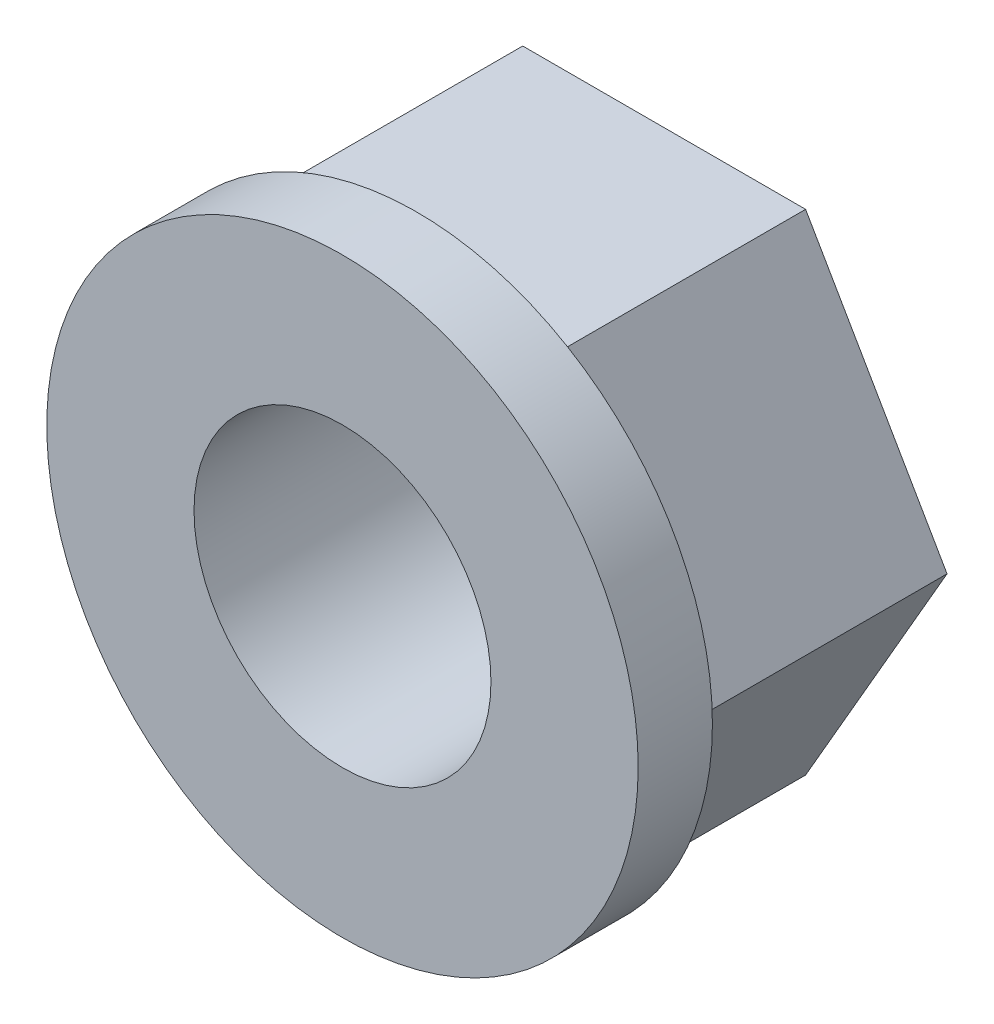
ISO-10303-21;
HEADER;
FILE_DESCRIPTION(('STEP AP214'),'2;1');
FILE_NAME('part.step','',(''),(''),'','','');
FILE_SCHEMA(('AUTOMOTIVE_DESIGN { 1 0 10303 214 1 1 1 1 }'));
ENDSEC;
DATA;
#1=APPLICATION_CONTEXT('core data for automotive mechanical design processes');
#2=APPLICATION_PROTOCOL_DEFINITION('international standard','automotive_design',2000,#1);
#3=PRODUCT_CONTEXT('',#1,'mechanical');
#4=PRODUCT('Part','Part','',(#3));
#5=PRODUCT_RELATED_PRODUCT_CATEGORY('part','',(#4));
#6=PRODUCT_DEFINITION_FORMATION('','',#4);
#7=PRODUCT_DEFINITION_CONTEXT('part definition',#1,'design');
#8=PRODUCT_DEFINITION('design','',#6,#7);
#9=PRODUCT_DEFINITION_SHAPE('','',#8);
#10=(LENGTH_UNIT() NAMED_UNIT(*) SI_UNIT(.MILLI.,.METRE.));
#11=(NAMED_UNIT(*) PLANE_ANGLE_UNIT() SI_UNIT($,.RADIAN.));
#12=(NAMED_UNIT(*) SI_UNIT($,.STERADIAN.) SOLID_ANGLE_UNIT());
#13=UNCERTAINTY_MEASURE_WITH_UNIT(LENGTH_MEASURE(1.E-05),#10,'distance_accuracy_value','');
#14=(GEOMETRIC_REPRESENTATION_CONTEXT(3) GLOBAL_UNCERTAINTY_ASSIGNED_CONTEXT((#13)) GLOBAL_UNIT_ASSIGNED_CONTEXT((#10,
#11,#12)) REPRESENTATION_CONTEXT('',''));
#15=CARTESIAN_POINT('',(0.,0.,0.));
#16=DIRECTION('',(0.,0.,1.));
#17=DIRECTION('',(1.,0.,0.));
#18=AXIS2_PLACEMENT_3D('',#15,#16,#17);
#19=CARTESIAN_POINT('',(0.,0.,0.));
#20=DIRECTION('',(0.,0.,1.));
#21=DIRECTION('',(1.,0.,0.));
#22=AXIS2_PLACEMENT_3D('',#19,#20,#21);
#23=PLANE('',#22);
#24=DIRECTION('',(-0.499999999999995,-0.866025403784442,0.));
#25=VECTOR('',#24,1.);
#26=CARTESIAN_POINT('',(-2.8578838324887,4.94999999999996,0.));
#27=LINE('',#26,#25);
#28=CARTESIAN_POINT('',(-2.8578838324887,4.94999999999996,0.));
#29=VERTEX_POINT('',#28);
#30=CARTESIAN_POINT('',(-5.71576766497729,0.,0.));
#31=VERTEX_POINT('',#30);
#32=EDGE_CURVE('E130',#29,#31,#27,.T.);
#33=ORIENTED_EDGE('',*,*,#32,.F.);
#34=DIRECTION('',(-1.,0.,0.));
#35=VECTOR('',#34,1.);
#36=CARTESIAN_POINT('',(2.8578838324886,4.95000000000002,0.));
#37=LINE('',#36,#35);
#38=CARTESIAN_POINT('',(2.8578838324886,4.95000000000002,0.));
#39=VERTEX_POINT('',#38);
#40=EDGE_CURVE('E83',#39,#29,#37,.T.);
#41=ORIENTED_EDGE('',*,*,#40,.F.);
#42=DIRECTION('',(-0.500000000000007,0.866025403784435,0.));
#43=VECTOR('',#42,1.);
#44=CARTESIAN_POINT('',(5.71576766497729,0.,0.));
#45=LINE('',#44,#43);
#46=CARTESIAN_POINT('',(5.71576766497729,0.,0.));
#47=VERTEX_POINT('',#46);
#48=EDGE_CURVE('E77',#47,#39,#45,.T.);
#49=ORIENTED_EDGE('',*,*,#48,.F.);
#50=DIRECTION('',(0.499999999999995,0.866025403784442,0.));
#51=VECTOR('',#50,1.);
#52=CARTESIAN_POINT('',(2.85788383248867,-4.94999999999998,0.));
#53=LINE('',#52,#51);
#54=CARTESIAN_POINT('',(2.85788383248867,-4.94999999999998,0.));
#55=VERTEX_POINT('',#54);
#56=EDGE_CURVE('E137',#55,#47,#53,.T.);
#57=ORIENTED_EDGE('',*,*,#56,.F.);
#58=DIRECTION('',(1.,0.,0.));
#59=VECTOR('',#58,1.);
#60=CARTESIAN_POINT('',(-2.85788383248863,-4.95,0.));
#61=LINE('',#60,#59);
#62=CARTESIAN_POINT('',(-2.85788383248863,-4.95,0.));
#63=VERTEX_POINT('',#62);
#64=EDGE_CURVE('E106',#63,#55,#61,.T.);
#65=ORIENTED_EDGE('',*,*,#64,.F.);
#66=DIRECTION('',(0.500000000000001,-0.866025403784438,0.));
#67=VECTOR('',#66,1.);
#68=CARTESIAN_POINT('',(-5.71576766497729,0.,0.));
#69=LINE('',#68,#67);
#70=EDGE_CURVE('E133',#31,#63,#69,.T.);
#71=ORIENTED_EDGE('',*,*,#70,.F.);
#72=EDGE_LOOP('',(#33,#41,#49,#57,#65,#71));
#73=FACE_BOUND('',#72,.T.);
#74=CARTESIAN_POINT('',(0.,0.,0.));
#75=DIRECTION('',(0.,0.,1.));
#76=DIRECTION('',(1.,0.,0.));
#77=AXIS2_PLACEMENT_3D('',#74,#75,#76);
#78=CIRCLE('',#77,3.);
#79=CARTESIAN_POINT('',(3.,0.,0.));
#80=VERTEX_POINT('',#79);
#81=EDGE_CURVE('E134',#80,#80,#78,.T.);
#82=ORIENTED_EDGE('',*,*,#81,.T.);
#83=EDGE_LOOP('',(#82));
#84=FACE_BOUND('',#83,.T.);
#85=ADVANCED_FACE('F38',(#73,#84),#23,.F.);
#86=CARTESIAN_POINT('',(-2.8578838324887,4.94999999999996,5.));
#87=DIRECTION('',(0.866025403784442,-0.499999999999995,0.));
#88=DIRECTION('',(0.499999999999995,0.866025403784442,0.));
#89=AXIS2_PLACEMENT_3D('',#86,#87,#88);
#90=PLANE('',#89);
#91=ORIENTED_EDGE('',*,*,#32,.T.);
#92=DIRECTION('',(0.,0.,-1.));
#93=VECTOR('',#92,1.);
#94=CARTESIAN_POINT('',(-5.71576766497729,0.,5.));
#95=LINE('',#94,#93);
#96=CARTESIAN_POINT('',(-5.71576766497729,0.,5.));
#97=VERTEX_POINT('',#96);
#98=EDGE_CURVE('E11',#97,#31,#95,.T.);
#99=ORIENTED_EDGE('',*,*,#98,.F.);
#100=DIRECTION('',(-0.499999999999995,-0.866025403784442,0.));
#101=VECTOR('',#100,1.);
#102=CARTESIAN_POINT('',(-2.8578838324887,4.94999999999996,5.));
#103=LINE('',#102,#101);
#104=CARTESIAN_POINT('',(-2.8578838324887,4.94999999999996,5.));
#105=VERTEX_POINT('',#104);
#106=EDGE_CURVE('E122',#105,#97,#103,.T.);
#107=ORIENTED_EDGE('',*,*,#106,.F.);
#108=DIRECTION('',(0.,0.,-1.));
#109=VECTOR('',#108,1.);
#110=CARTESIAN_POINT('',(-2.8578838324887,4.94999999999996,5.));
#111=LINE('',#110,#109);
#112=EDGE_CURVE('E129',#105,#29,#111,.T.);
#113=ORIENTED_EDGE('',*,*,#112,.T.);
#114=EDGE_LOOP('',(#91,#99,#107,#113));
#115=FACE_BOUND('',#114,.T.);
#116=ADVANCED_FACE('F40',(#115),#90,.F.);
#117=CARTESIAN_POINT('',(-5.71576766497729,0.,5.));
#118=DIRECTION('',(0.866025403784438,0.500000000000001,0.));
#119=DIRECTION('',(-0.500000000000001,0.866025403784438,0.));
#120=AXIS2_PLACEMENT_3D('',#117,#118,#119);
#121=PLANE('',#120);
#122=ORIENTED_EDGE('',*,*,#70,.T.);
#123=DIRECTION('',(0.,0.,-1.));
#124=VECTOR('',#123,1.);
#125=CARTESIAN_POINT('',(-2.85788383248863,-4.95,5.));
#126=LINE('',#125,#124);
#127=CARTESIAN_POINT('',(-2.85788383248863,-4.95,5.));
#128=VERTEX_POINT('',#127);
#129=EDGE_CURVE('E47',#128,#63,#126,.T.);
#130=ORIENTED_EDGE('',*,*,#129,.F.);
#131=DIRECTION('',(0.500000000000001,-0.866025403784438,0.));
#132=VECTOR('',#131,1.);
#133=CARTESIAN_POINT('',(-5.71576766497729,0.,5.));
#134=LINE('',#133,#132);
#135=EDGE_CURVE('E91',#97,#128,#134,.T.);
#136=ORIENTED_EDGE('',*,*,#135,.F.);
#137=ORIENTED_EDGE('',*,*,#98,.T.);
#138=EDGE_LOOP('',(#122,#130,#136,#137));
#139=FACE_BOUND('',#138,.T.);
#140=ADVANCED_FACE('F183',(#139),#121,.F.);
#141=CARTESIAN_POINT('',(-2.85788383248863,-4.95,5.));
#142=DIRECTION('',(0.,1.,0.));
#143=DIRECTION('',(-1.,0.,0.));
#144=AXIS2_PLACEMENT_3D('',#141,#142,#143);
#145=PLANE('',#144);
#146=ORIENTED_EDGE('',*,*,#64,.T.);
#147=DIRECTION('',(0.,0.,-1.));
#148=VECTOR('',#147,1.);
#149=CARTESIAN_POINT('',(2.85788383248867,-4.94999999999998,5.));
#150=LINE('',#149,#148);
#151=CARTESIAN_POINT('',(2.85788383248867,-4.94999999999998,5.));
#152=VERTEX_POINT('',#151);
#153=EDGE_CURVE('E99',#152,#55,#150,.T.);
#154=ORIENTED_EDGE('',*,*,#153,.F.);
#155=DIRECTION('',(1.,0.,0.));
#156=VECTOR('',#155,1.);
#157=CARTESIAN_POINT('',(-2.85788383248863,-4.95,5.));
#158=LINE('',#157,#156);
#159=EDGE_CURVE('E104',#128,#152,#158,.T.);
#160=ORIENTED_EDGE('',*,*,#159,.F.);
#161=ORIENTED_EDGE('',*,*,#129,.T.);
#162=EDGE_LOOP('',(#146,#154,#160,#161));
#163=FACE_BOUND('',#162,.T.);
#164=ADVANCED_FACE('F101',(#163),#145,.F.);
#165=CARTESIAN_POINT('',(2.85788383248867,-4.94999999999998,5.));
#166=DIRECTION('',(-0.866025403784442,0.499999999999995,0.));
#167=DIRECTION('',(-0.499999999999995,-0.866025403784442,0.));
#168=AXIS2_PLACEMENT_3D('',#165,#166,#167);
#169=PLANE('',#168);
#170=ORIENTED_EDGE('',*,*,#56,.T.);
#171=DIRECTION('',(0.,0.,-1.));
#172=VECTOR('',#171,1.);
#173=CARTESIAN_POINT('',(5.71576766497729,0.,5.));
#174=LINE('',#173,#172);
#175=CARTESIAN_POINT('',(5.71576766497729,0.,5.));
#176=VERTEX_POINT('',#175);
#177=EDGE_CURVE('E109',#176,#47,#174,.T.);
#178=ORIENTED_EDGE('',*,*,#177,.F.);
#179=DIRECTION('',(0.499999999999995,0.866025403784442,0.));
#180=VECTOR('',#179,1.);
#181=CARTESIAN_POINT('',(2.85788383248867,-4.94999999999998,5.));
#182=LINE('',#181,#180);
#183=EDGE_CURVE('E112',#152,#176,#182,.T.);
#184=ORIENTED_EDGE('',*,*,#183,.F.);
#185=ORIENTED_EDGE('',*,*,#153,.T.);
#186=EDGE_LOOP('',(#170,#178,#184,#185));
#187=FACE_BOUND('',#186,.T.);
#188=ADVANCED_FACE('F113',(#187),#169,.F.);
#189=CARTESIAN_POINT('',(5.71576766497729,0.,5.));
#190=DIRECTION('',(-0.866025403784435,-0.500000000000007,0.));
#191=DIRECTION('',(0.500000000000007,-0.866025403784435,0.));
#192=AXIS2_PLACEMENT_3D('',#189,#190,#191);
#193=PLANE('',#192);
#194=ORIENTED_EDGE('',*,*,#48,.T.);
#195=DIRECTION('',(0.,0.,-1.));
#196=VECTOR('',#195,1.);
#197=CARTESIAN_POINT('',(2.8578838324886,4.95000000000002,5.));
#198=LINE('',#197,#196);
#199=CARTESIAN_POINT('',(2.8578838324886,4.95000000000002,5.));
#200=VERTEX_POINT('',#199);
#201=EDGE_CURVE('E55',#200,#39,#198,.T.);
#202=ORIENTED_EDGE('',*,*,#201,.F.);
#203=DIRECTION('',(-0.500000000000007,0.866025403784435,0.));
#204=VECTOR('',#203,1.);
#205=CARTESIAN_POINT('',(5.71576766497729,0.,5.));
#206=LINE('',#205,#204);
#207=EDGE_CURVE('E116',#176,#200,#206,.T.);
#208=ORIENTED_EDGE('',*,*,#207,.F.);
#209=ORIENTED_EDGE('',*,*,#177,.T.);
#210=EDGE_LOOP('',(#194,#202,#208,#209));
#211=FACE_BOUND('',#210,.T.);
#212=ADVANCED_FACE('F146',(#211),#193,.F.);
#213=CARTESIAN_POINT('',(2.8578838324886,4.95000000000002,5.));
#214=DIRECTION('',(0.,-1.,0.));
#215=DIRECTION('',(1.,0.,0.));
#216=AXIS2_PLACEMENT_3D('',#213,#214,#215);
#217=PLANE('',#216);
#218=ORIENTED_EDGE('',*,*,#40,.T.);
#219=ORIENTED_EDGE('',*,*,#112,.F.);
#220=DIRECTION('',(-1.,0.,0.));
#221=VECTOR('',#220,1.);
#222=CARTESIAN_POINT('',(2.8578838324886,4.95000000000002,5.));
#223=LINE('',#222,#221);
#224=EDGE_CURVE('E127',#200,#105,#223,.T.);
#225=ORIENTED_EDGE('',*,*,#224,.F.);
#226=ORIENTED_EDGE('',*,*,#201,.T.);
#227=EDGE_LOOP('',(#218,#219,#225,#226));
#228=FACE_BOUND('',#227,.T.);
#229=ADVANCED_FACE('F148',(#228),#217,.F.);
#230=CARTESIAN_POINT('',(0.,0.,5.));
#231=DIRECTION('',(0.,0.,-1.));
#232=DIRECTION('',(-1.,0.,0.));
#233=AXIS2_PLACEMENT_3D('',#230,#231,#232);
#234=CYLINDRICAL_SURFACE('',#233,3.);
#235=ORIENTED_EDGE('',*,*,#81,.F.);
#236=EDGE_LOOP('',(#235));
#237=FACE_BOUND('',#236,.T.);
#238=CARTESIAN_POINT('',(0.,0.,6.5));
#239=DIRECTION('',(0.,0.,1.));
#240=DIRECTION('',(1.,0.,0.));
#241=AXIS2_PLACEMENT_3D('',#238,#239,#240);
#242=CIRCLE('',#241,3.);
#243=CARTESIAN_POINT('',(3.,0.,6.5));
#244=VERTEX_POINT('',#243);
#245=EDGE_CURVE('E157',#244,#244,#242,.T.);
#246=ORIENTED_EDGE('',*,*,#245,.T.);
#247=EDGE_LOOP('',(#246));
#248=FACE_BOUND('',#247,.T.);
#249=ADVANCED_FACE('F163',(#237,#248),#234,.F.);
#250=CARTESIAN_POINT('',(0.,0.,5.));
#251=DIRECTION('',(0.,0.,1.));
#252=DIRECTION('',(1.,0.,0.));
#253=AXIS2_PLACEMENT_3D('',#250,#251,#252);
#254=PLANE('',#253);
#255=CARTESIAN_POINT('',(0.,0.,5.));
#256=DIRECTION('',(0.,0.,1.));
#257=DIRECTION('',(1.,0.,0.));
#258=AXIS2_PLACEMENT_3D('',#255,#256,#257);
#259=CIRCLE('',#258,5.975);
#260=CARTESIAN_POINT('',(5.975,0.,5.));
#261=VERTEX_POINT('',#260);
#262=EDGE_CURVE('E154',#261,#261,#259,.T.);
#263=ORIENTED_EDGE('',*,*,#262,.F.);
#264=EDGE_LOOP('',(#263));
#265=FACE_BOUND('',#264,.T.);
#266=ORIENTED_EDGE('',*,*,#224,.T.);
#267=ORIENTED_EDGE('',*,*,#106,.T.);
#268=ORIENTED_EDGE('',*,*,#135,.T.);
#269=ORIENTED_EDGE('',*,*,#159,.T.);
#270=ORIENTED_EDGE('',*,*,#183,.T.);
#271=ORIENTED_EDGE('',*,*,#207,.T.);
#272=EDGE_LOOP('',(#266,#267,#268,#269,#270,#271));
#273=FACE_BOUND('',#272,.T.);
#274=ADVANCED_FACE('F119',(#265,#273),#254,.F.);
#275=CARTESIAN_POINT('',(0.,0.,6.5));
#276=DIRECTION('',(0.,0.,1.));
#277=DIRECTION('',(1.,0.,0.));
#278=AXIS2_PLACEMENT_3D('',#275,#276,#277);
#279=PLANE('',#278);
#280=CARTESIAN_POINT('',(0.,0.,6.5));
#281=DIRECTION('',(0.,0.,1.));
#282=DIRECTION('',(1.,0.,0.));
#283=AXIS2_PLACEMENT_3D('',#280,#281,#282);
#284=CIRCLE('',#283,5.975);
#285=CARTESIAN_POINT('',(5.975,0.,6.5));
#286=VERTEX_POINT('',#285);
#287=EDGE_CURVE('E153',#286,#286,#284,.T.);
#288=ORIENTED_EDGE('',*,*,#287,.T.);
#289=EDGE_LOOP('',(#288));
#290=FACE_BOUND('',#289,.T.);
#291=ORIENTED_EDGE('',*,*,#245,.F.);
#292=EDGE_LOOP('',(#291));
#293=FACE_BOUND('',#292,.T.);
#294=ADVANCED_FACE('F165',(#290,#293),#279,.T.);
#295=CARTESIAN_POINT('',(0.,0.,6.5));
#296=DIRECTION('',(0.,0.,-1.));
#297=DIRECTION('',(-1.,0.,0.));
#298=AXIS2_PLACEMENT_3D('',#295,#296,#297);
#299=CYLINDRICAL_SURFACE('',#298,5.975);
#300=ORIENTED_EDGE('',*,*,#287,.F.);
#301=EDGE_LOOP('',(#300));
#302=FACE_BOUND('',#301,.T.);
#303=ORIENTED_EDGE('',*,*,#262,.T.);
#304=EDGE_LOOP('',(#303));
#305=FACE_BOUND('',#304,.T.);
#306=ADVANCED_FACE('F167',(#302,#305),#299,.T.);
#307=CLOSED_SHELL('',(#85,#116,#140,#164,#188,#212,#229,#249,#274,#294,#306));
#308=MANIFOLD_SOLID_BREP('B2',#307);
#309=ADVANCED_BREP_SHAPE_REPRESENTATION('',(#18,#308),#14);
#310=SHAPE_DEFINITION_REPRESENTATION(#9,#309);
ENDSEC;
END-ISO-10303-21;
